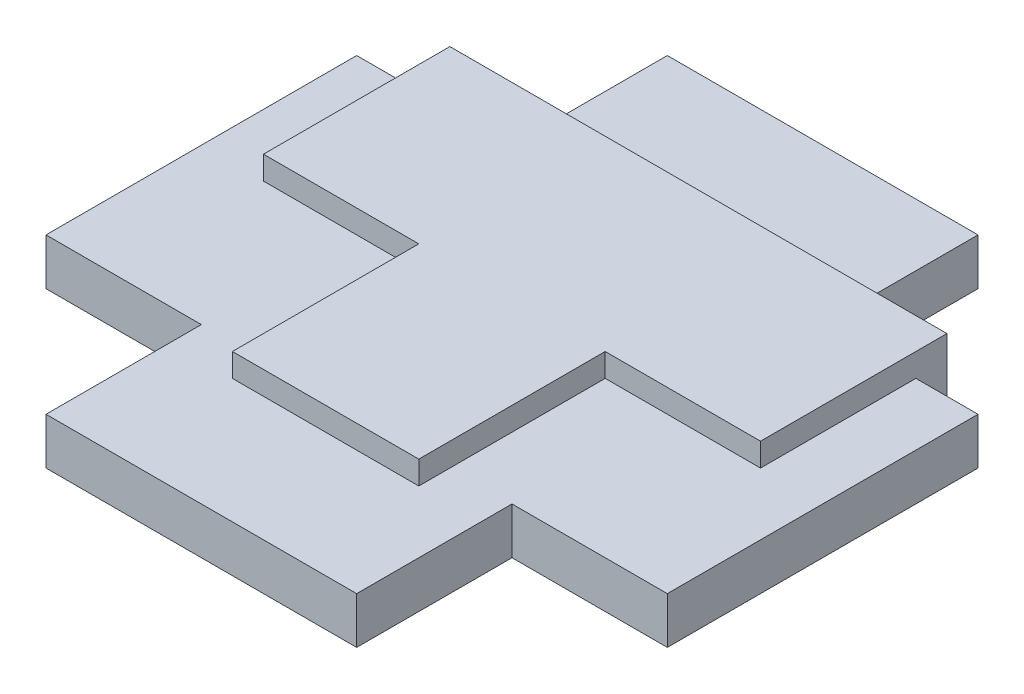
ISO-10303-21;
HEADER;
FILE_DESCRIPTION(('STEP AP214'),'2;1');
FILE_NAME('part.step','',(''),(''),'','','');
FILE_SCHEMA(('AUTOMOTIVE_DESIGN { 1 0 10303 214 1 1 1 1 }'));
ENDSEC;
DATA;
#1=APPLICATION_CONTEXT('core data for automotive mechanical design processes');
#2=APPLICATION_PROTOCOL_DEFINITION('international standard','automotive_design',2000,#1);
#3=PRODUCT_CONTEXT('',#1,'mechanical');
#4=PRODUCT('Part','Part','',(#3));
#5=PRODUCT_RELATED_PRODUCT_CATEGORY('part','',(#4));
#6=PRODUCT_DEFINITION_FORMATION('','',#4);
#7=PRODUCT_DEFINITION_CONTEXT('part definition',#1,'design');
#8=PRODUCT_DEFINITION('design','',#6,#7);
#9=PRODUCT_DEFINITION_SHAPE('','',#8);
#10=(LENGTH_UNIT() NAMED_UNIT(*) SI_UNIT(.MILLI.,.METRE.));
#11=(NAMED_UNIT(*) PLANE_ANGLE_UNIT() SI_UNIT($,.RADIAN.));
#12=(NAMED_UNIT(*) SI_UNIT($,.STERADIAN.) SOLID_ANGLE_UNIT());
#13=UNCERTAINTY_MEASURE_WITH_UNIT(LENGTH_MEASURE(1.E-05),#10,'distance_accuracy_value','');
#14=(GEOMETRIC_REPRESENTATION_CONTEXT(3) GLOBAL_UNCERTAINTY_ASSIGNED_CONTEXT((#13)) GLOBAL_UNIT_ASSIGNED_CONTEXT((#10,
#11,#12)) REPRESENTATION_CONTEXT('',''));
#15=CARTESIAN_POINT('',(0.,0.,0.));
#16=DIRECTION('',(0.,0.,1.));
#17=DIRECTION('',(1.,0.,0.));
#18=AXIS2_PLACEMENT_3D('',#15,#16,#17);
#19=CARTESIAN_POINT('',(3.,3.,0.));
#20=DIRECTION('',(1.,0.,0.));
#21=DIRECTION('',(0.,0.,-1.));
#22=AXIS2_PLACEMENT_3D('',#19,#20,#21);
#23=PLANE('',#22);
#24=DIRECTION('',(0.,-1.,0.));
#25=VECTOR('',#24,1.);
#26=CARTESIAN_POINT('',(3.,3.,0.));
#27=LINE('',#26,#25);
#28=CARTESIAN_POINT('',(3.,0.75,0.));
#29=VERTEX_POINT('',#28);
#30=CARTESIAN_POINT('',(3.,0.,0.));
#31=VERTEX_POINT('',#30);
#32=EDGE_CURVE('E490',#29,#31,#27,.T.);
#33=ORIENTED_EDGE('',*,*,#32,.F.);
#34=DIRECTION('',(0.,0.,1.));
#35=VECTOR('',#34,1.);
#36=CARTESIAN_POINT('',(3.,0.75,0.));
#37=LINE('',#36,#35);
#38=CARTESIAN_POINT('',(3.,0.75,6.));
#39=VERTEX_POINT('',#38);
#40=EDGE_CURVE('E394',#29,#39,#37,.T.);
#41=ORIENTED_EDGE('',*,*,#40,.T.);
#42=DIRECTION('',(0.,-1.,0.));
#43=VECTOR('',#42,1.);
#44=CARTESIAN_POINT('',(3.,3.,6.));
#45=LINE('',#44,#43);
#46=CARTESIAN_POINT('',(3.,0.,6.));
#47=VERTEX_POINT('',#46);
#48=EDGE_CURVE('E434',#39,#47,#45,.T.);
#49=ORIENTED_EDGE('',*,*,#48,.T.);
#50=DIRECTION('',(0.,0.,1.));
#51=VECTOR('',#50,1.);
#52=CARTESIAN_POINT('',(3.,0.,0.));
#53=LINE('',#52,#51);
#54=EDGE_CURVE('E406',#31,#47,#53,.T.);
#55=ORIENTED_EDGE('',*,*,#54,.F.);
#56=EDGE_LOOP('',(#33,#41,#49,#55));
#57=FACE_BOUND('',#56,.T.);
#58=ADVANCED_FACE('F41',(#57),#23,.T.);
#59=CARTESIAN_POINT('',(0.,3.,0.));
#60=DIRECTION('',(0.,0.,-1.));
#61=DIRECTION('',(-1.,0.,0.));
#62=AXIS2_PLACEMENT_3D('',#59,#60,#61);
#63=PLANE('',#62);
#64=DIRECTION('',(1.,0.,0.));
#65=VECTOR('',#64,1.);
#66=CARTESIAN_POINT('',(0.,0.75,0.));
#67=LINE('',#66,#65);
#68=CARTESIAN_POINT('',(8.,0.75,0.));
#69=VERTEX_POINT('',#68);
#70=EDGE_CURVE('E57',#29,#69,#67,.T.);
#71=ORIENTED_EDGE('',*,*,#70,.F.);
#72=ORIENTED_EDGE('',*,*,#32,.T.);
#73=DIRECTION('',(1.,0.,0.));
#74=VECTOR('',#73,1.);
#75=CARTESIAN_POINT('',(0.,0.,0.));
#76=LINE('',#75,#74);
#77=CARTESIAN_POINT('',(8.,0.,0.));
#78=VERTEX_POINT('',#77);
#79=EDGE_CURVE('E438',#31,#78,#76,.T.);
#80=ORIENTED_EDGE('',*,*,#79,.T.);
#81=DIRECTION('',(0.,-1.,0.));
#82=VECTOR('',#81,1.);
#83=CARTESIAN_POINT('',(8.,3.,0.));
#84=LINE('',#83,#82);
#85=EDGE_CURVE('E485',#69,#78,#84,.T.);
#86=ORIENTED_EDGE('',*,*,#85,.F.);
#87=EDGE_LOOP('',(#71,#72,#80,#86));
#88=FACE_BOUND('',#87,.T.);
#89=ADVANCED_FACE('F539',(#88),#63,.F.);
#90=CARTESIAN_POINT('',(8.,3.,0.));
#91=DIRECTION('',(-1.,0.,0.));
#92=DIRECTION('',(0.,0.,1.));
#93=AXIS2_PLACEMENT_3D('',#90,#91,#92);
#94=PLANE('',#93);
#95=DIRECTION('',(0.,0.,-1.));
#96=VECTOR('',#95,1.);
#97=CARTESIAN_POINT('',(8.,0.75,0.));
#98=LINE('',#97,#96);
#99=CARTESIAN_POINT('',(8.,0.75,-5.));
#100=VERTEX_POINT('',#99);
#101=EDGE_CURVE('E399',#69,#100,#98,.T.);
#102=ORIENTED_EDGE('',*,*,#101,.F.);
#103=ORIENTED_EDGE('',*,*,#85,.T.);
#104=DIRECTION('',(0.,0.,-1.));
#105=VECTOR('',#104,1.);
#106=CARTESIAN_POINT('',(8.,0.,0.));
#107=LINE('',#106,#105);
#108=CARTESIAN_POINT('',(8.,0.,-6.));
#109=VERTEX_POINT('',#108);
#110=EDGE_CURVE('E442',#78,#109,#107,.T.);
#111=ORIENTED_EDGE('',*,*,#110,.T.);
#112=DIRECTION('',(0.,-1.,0.));
#113=VECTOR('',#112,1.);
#114=CARTESIAN_POINT('',(8.,3.,-6.));
#115=LINE('',#114,#113);
#116=CARTESIAN_POINT('',(8.,3.,-6.));
#117=VERTEX_POINT('',#116);
#118=EDGE_CURVE('E482',#117,#109,#115,.T.);
#119=ORIENTED_EDGE('',*,*,#118,.F.);
#120=DIRECTION('',(0.,0.,-1.));
#121=VECTOR('',#120,1.);
#122=CARTESIAN_POINT('',(8.,3.,0.));
#123=LINE('',#122,#121);
#124=CARTESIAN_POINT('',(8.,3.,0.));
#125=VERTEX_POINT('',#124);
#126=EDGE_CURVE('E415',#125,#117,#123,.T.);
#127=ORIENTED_EDGE('',*,*,#126,.F.);
#128=CARTESIAN_POINT('',(8.,2.25,0.));
#129=VERTEX_POINT('',#128);
#130=EDGE_CURVE('E486',#125,#129,#84,.T.);
#131=ORIENTED_EDGE('',*,*,#130,.T.);
#132=DIRECTION('',(0.,0.,-1.));
#133=VECTOR('',#132,1.);
#134=CARTESIAN_POINT('',(8.,2.25,0.));
#135=LINE('',#134,#133);
#136=CARTESIAN_POINT('',(8.,2.25,-5.));
#137=VERTEX_POINT('',#136);
#138=EDGE_CURVE('E376',#129,#137,#135,.T.);
#139=ORIENTED_EDGE('',*,*,#138,.T.);
#140=DIRECTION('',(0.,-1.,0.));
#141=VECTOR('',#140,1.);
#142=CARTESIAN_POINT('',(8.,3.,-5.));
#143=LINE('',#142,#141);
#144=EDGE_CURVE('E11',#137,#100,#143,.T.);
#145=ORIENTED_EDGE('',*,*,#144,.T.);
#146=EDGE_LOOP('',(#102,#103,#111,#119,#127,#131,#139,#145));
#147=FACE_BOUND('',#146,.T.);
#148=ADVANCED_FACE('F544',(#147),#94,.F.);
#149=CARTESIAN_POINT('',(0.,3.,-6.));
#150=DIRECTION('',(0.,0.,-1.));
#151=DIRECTION('',(-1.,0.,0.));
#152=AXIS2_PLACEMENT_3D('',#149,#150,#151);
#153=PLANE('',#152);
#154=DIRECTION('',(1.,0.,0.));
#155=VECTOR('',#154,1.);
#156=CARTESIAN_POINT('',(0.,0.,-6.));
#157=LINE('',#156,#155);
#158=CARTESIAN_POINT('',(-8.,0.,-6.));
#159=VERTEX_POINT('',#158);
#160=EDGE_CURVE('E447',#159,#109,#157,.T.);
#161=ORIENTED_EDGE('',*,*,#160,.F.);
#162=DIRECTION('',(0.,-1.,0.));
#163=VECTOR('',#162,1.);
#164=CARTESIAN_POINT('',(-8.,3.,-6.));
#165=LINE('',#164,#163);
#166=CARTESIAN_POINT('',(-8.,3.,-6.));
#167=VERTEX_POINT('',#166);
#168=EDGE_CURVE('E479',#167,#159,#165,.T.);
#169=ORIENTED_EDGE('',*,*,#168,.F.);
#170=DIRECTION('',(1.,0.,0.));
#171=VECTOR('',#170,1.);
#172=CARTESIAN_POINT('',(0.,3.,-6.));
#173=LINE('',#172,#171);
#174=EDGE_CURVE('E419',#167,#117,#173,.T.);
#175=ORIENTED_EDGE('',*,*,#174,.T.);
#176=ORIENTED_EDGE('',*,*,#118,.T.);
#177=EDGE_LOOP('',(#161,#169,#175,#176));
#178=FACE_BOUND('',#177,.T.);
#179=DIRECTION('',(0.,-1.,0.));
#180=VECTOR('',#179,1.);
#181=CARTESIAN_POINT('',(-5.,3.,-6.));
#182=LINE('',#181,#180);
#183=CARTESIAN_POINT('',(-5.,2.25,-6.));
#184=VERTEX_POINT('',#183);
#185=CARTESIAN_POINT('',(-5.,0.75,-6.));
#186=VERTEX_POINT('',#185);
#187=EDGE_CURVE('E50',#184,#186,#182,.T.);
#188=ORIENTED_EDGE('',*,*,#187,.T.);
#189=DIRECTION('',(1.,0.,0.));
#190=VECTOR('',#189,1.);
#191=CARTESIAN_POINT('',(0.,0.75,-6.));
#192=LINE('',#191,#190);
#193=CARTESIAN_POINT('',(5.,0.75,-6.));
#194=VERTEX_POINT('',#193);
#195=EDGE_CURVE('E403',#186,#194,#192,.T.);
#196=ORIENTED_EDGE('',*,*,#195,.T.);
#197=DIRECTION('',(0.,-1.,0.));
#198=VECTOR('',#197,1.);
#199=CARTESIAN_POINT('',(5.,3.,-6.));
#200=LINE('',#199,#198);
#201=CARTESIAN_POINT('',(5.,2.25,-6.));
#202=VERTEX_POINT('',#201);
#203=EDGE_CURVE('E504',#202,#194,#200,.T.);
#204=ORIENTED_EDGE('',*,*,#203,.F.);
#205=DIRECTION('',(1.,0.,0.));
#206=VECTOR('',#205,1.);
#207=CARTESIAN_POINT('',(0.,2.25,-6.));
#208=LINE('',#207,#206);
#209=EDGE_CURVE('E379',#184,#202,#208,.T.);
#210=ORIENTED_EDGE('',*,*,#209,.F.);
#211=EDGE_LOOP('',(#188,#196,#204,#210));
#212=FACE_BOUND('',#211,.T.);
#213=ADVANCED_FACE('F511',(#178,#212),#153,.T.);
#214=CARTESIAN_POINT('',(-8.,3.,0.));
#215=DIRECTION('',(-1.,0.,0.));
#216=DIRECTION('',(0.,0.,1.));
#217=AXIS2_PLACEMENT_3D('',#214,#215,#216);
#218=PLANE('',#217);
#219=DIRECTION('',(0.,-1.,0.));
#220=VECTOR('',#219,1.);
#221=CARTESIAN_POINT('',(-8.,3.,0.));
#222=LINE('',#221,#220);
#223=CARTESIAN_POINT('',(-8.,0.75,0.));
#224=VERTEX_POINT('',#223);
#225=CARTESIAN_POINT('',(-8.,0.,0.));
#226=VERTEX_POINT('',#225);
#227=EDGE_CURVE('E474',#224,#226,#222,.T.);
#228=ORIENTED_EDGE('',*,*,#227,.F.);
#229=DIRECTION('',(0.,0.,-1.));
#230=VECTOR('',#229,1.);
#231=CARTESIAN_POINT('',(-8.,0.75,0.));
#232=LINE('',#231,#230);
#233=CARTESIAN_POINT('',(-8.,0.75,-5.));
#234=VERTEX_POINT('',#233);
#235=EDGE_CURVE('E391',#224,#234,#232,.T.);
#236=ORIENTED_EDGE('',*,*,#235,.T.);
#237=DIRECTION('',(0.,-1.,0.));
#238=VECTOR('',#237,1.);
#239=CARTESIAN_POINT('',(-8.,3.,-5.));
#240=LINE('',#239,#238);
#241=CARTESIAN_POINT('',(-8.,2.25,-5.));
#242=VERTEX_POINT('',#241);
#243=EDGE_CURVE('E501',#242,#234,#240,.T.);
#244=ORIENTED_EDGE('',*,*,#243,.F.);
#245=DIRECTION('',(0.,0.,-1.));
#246=VECTOR('',#245,1.);
#247=CARTESIAN_POINT('',(-8.,2.25,0.));
#248=LINE('',#247,#246);
#249=CARTESIAN_POINT('',(-8.,2.25,0.));
#250=VERTEX_POINT('',#249);
#251=EDGE_CURVE('E238',#250,#242,#248,.T.);
#252=ORIENTED_EDGE('',*,*,#251,.F.);
#253=CARTESIAN_POINT('',(-8.,3.,0.));
#254=VERTEX_POINT('',#253);
#255=EDGE_CURVE('E475',#254,#250,#222,.T.);
#256=ORIENTED_EDGE('',*,*,#255,.F.);
#257=DIRECTION('',(0.,0.,-1.));
#258=VECTOR('',#257,1.);
#259=CARTESIAN_POINT('',(-8.,3.,0.));
#260=LINE('',#259,#258);
#261=EDGE_CURVE('E423',#254,#167,#260,.T.);
#262=ORIENTED_EDGE('',*,*,#261,.T.);
#263=ORIENTED_EDGE('',*,*,#168,.T.);
#264=DIRECTION('',(0.,0.,-1.));
#265=VECTOR('',#264,1.);
#266=CARTESIAN_POINT('',(-8.,0.,0.));
#267=LINE('',#266,#265);
#268=EDGE_CURVE('E451',#226,#159,#267,.T.);
#269=ORIENTED_EDGE('',*,*,#268,.F.);
#270=EDGE_LOOP('',(#228,#236,#244,#252,#256,#262,#263,#269));
#271=FACE_BOUND('',#270,.T.);
#272=ADVANCED_FACE('F598',(#271),#218,.T.);
#273=DIRECTION('',(1.,0.,0.));
#274=VECTOR('',#273,1.);
#275=CARTESIAN_POINT('',(0.,0.75,0.));
#276=LINE('',#275,#274);
#277=CARTESIAN_POINT('',(-3.,0.75,0.));
#278=VERTEX_POINT('',#277);
#279=EDGE_CURVE('E387',#224,#278,#276,.T.);
#280=ORIENTED_EDGE('',*,*,#279,.F.);
#281=ORIENTED_EDGE('',*,*,#227,.T.);
#282=CARTESIAN_POINT('',(-3.,0.,0.));
#283=VERTEX_POINT('',#282);
#284=EDGE_CURVE('E443',#226,#283,#76,.T.);
#285=ORIENTED_EDGE('',*,*,#284,.T.);
#286=DIRECTION('',(0.,-1.,0.));
#287=VECTOR('',#286,1.);
#288=CARTESIAN_POINT('',(-3.,3.,0.));
#289=LINE('',#288,#287);
#290=EDGE_CURVE('E469',#278,#283,#289,.T.);
#291=ORIENTED_EDGE('',*,*,#290,.F.);
#292=EDGE_LOOP('',(#280,#281,#285,#291));
#293=FACE_BOUND('',#292,.T.);
#294=ADVANCED_FACE('F546',(#293),#63,.F.);
#295=CARTESIAN_POINT('',(-3.,3.,0.));
#296=DIRECTION('',(1.,0.,0.));
#297=DIRECTION('',(0.,0.,-1.));
#298=AXIS2_PLACEMENT_3D('',#295,#296,#297);
#299=PLANE('',#298);
#300=DIRECTION('',(0.,0.,1.));
#301=VECTOR('',#300,1.);
#302=CARTESIAN_POINT('',(-3.,0.75,0.));
#303=LINE('',#302,#301);
#304=CARTESIAN_POINT('',(-3.,0.75,6.));
#305=VERTEX_POINT('',#304);
#306=EDGE_CURVE('E383',#278,#305,#303,.T.);
#307=ORIENTED_EDGE('',*,*,#306,.F.);
#308=ORIENTED_EDGE('',*,*,#290,.T.);
#309=DIRECTION('',(0.,0.,1.));
#310=VECTOR('',#309,1.);
#311=CARTESIAN_POINT('',(-3.,0.,0.));
#312=LINE('',#311,#310);
#313=CARTESIAN_POINT('',(-3.,0.,6.));
#314=VERTEX_POINT('',#313);
#315=EDGE_CURVE('E455',#283,#314,#312,.T.);
#316=ORIENTED_EDGE('',*,*,#315,.T.);
#317=DIRECTION('',(0.,-1.,0.));
#318=VECTOR('',#317,1.);
#319=CARTESIAN_POINT('',(-3.,3.,6.));
#320=LINE('',#319,#318);
#321=EDGE_CURVE('E465',#305,#314,#320,.T.);
#322=ORIENTED_EDGE('',*,*,#321,.F.);
#323=EDGE_LOOP('',(#307,#308,#316,#322));
#324=FACE_BOUND('',#323,.T.);
#325=ADVANCED_FACE('F556',(#324),#299,.F.);
#326=CARTESIAN_POINT('',(0.,3.,6.));
#327=DIRECTION('',(0.,0.,1.));
#328=DIRECTION('',(1.,0.,0.));
#329=AXIS2_PLACEMENT_3D('',#326,#327,#328);
#330=PLANE('',#329);
#331=ORIENTED_EDGE('',*,*,#48,.F.);
#332=DIRECTION('',(-1.,0.,0.));
#333=VECTOR('',#332,1.);
#334=CARTESIAN_POINT('',(0.,0.75,6.));
#335=LINE('',#334,#333);
#336=EDGE_CURVE('E498',#39,#305,#335,.T.);
#337=ORIENTED_EDGE('',*,*,#336,.T.);
#338=ORIENTED_EDGE('',*,*,#321,.T.);
#339=DIRECTION('',(-1.,0.,0.));
#340=VECTOR('',#339,1.);
#341=CARTESIAN_POINT('',(0.,0.,6.));
#342=LINE('',#341,#340);
#343=EDGE_CURVE('E412',#47,#314,#342,.T.);
#344=ORIENTED_EDGE('',*,*,#343,.F.);
#345=EDGE_LOOP('',(#331,#337,#338,#344));
#346=FACE_BOUND('',#345,.T.);
#347=ADVANCED_FACE('F550',(#346),#330,.T.);
#348=DIRECTION('',(0.,0.,1.));
#349=VECTOR('',#348,1.);
#350=CARTESIAN_POINT('',(3.,2.25,0.));
#351=LINE('',#350,#349);
#352=CARTESIAN_POINT('',(3.,2.25,0.));
#353=VERTEX_POINT('',#352);
#354=CARTESIAN_POINT('',(3.,2.25,6.));
#355=VERTEX_POINT('',#354);
#356=EDGE_CURVE('E65',#353,#355,#351,.T.);
#357=ORIENTED_EDGE('',*,*,#356,.F.);
#358=CARTESIAN_POINT('',(3.,3.,0.));
#359=VERTEX_POINT('',#358);
#360=EDGE_CURVE('E491',#359,#353,#27,.T.);
#361=ORIENTED_EDGE('',*,*,#360,.F.);
#362=DIRECTION('',(0.,0.,1.));
#363=VECTOR('',#362,1.);
#364=CARTESIAN_POINT('',(3.,3.,0.));
#365=LINE('',#364,#363);
#366=CARTESIAN_POINT('',(3.,3.,6.));
#367=VERTEX_POINT('',#366);
#368=EDGE_CURVE('E407',#359,#367,#365,.T.);
#369=ORIENTED_EDGE('',*,*,#368,.T.);
#370=EDGE_CURVE('E462',#367,#355,#45,.T.);
#371=ORIENTED_EDGE('',*,*,#370,.T.);
#372=EDGE_LOOP('',(#357,#361,#369,#371));
#373=FACE_BOUND('',#372,.T.);
#374=ADVANCED_FACE('F43',(#373),#23,.T.);
#375=ORIENTED_EDGE('',*,*,#360,.T.);
#376=DIRECTION('',(1.,0.,0.));
#377=VECTOR('',#376,1.);
#378=CARTESIAN_POINT('',(0.,2.25,0.));
#379=LINE('',#378,#377);
#380=EDGE_CURVE('E373',#353,#129,#379,.T.);
#381=ORIENTED_EDGE('',*,*,#380,.T.);
#382=ORIENTED_EDGE('',*,*,#130,.F.);
#383=DIRECTION('',(1.,0.,0.));
#384=VECTOR('',#383,1.);
#385=CARTESIAN_POINT('',(0.,3.,0.));
#386=LINE('',#385,#384);
#387=EDGE_CURVE('E411',#359,#125,#386,.T.);
#388=ORIENTED_EDGE('',*,*,#387,.F.);
#389=EDGE_LOOP('',(#375,#381,#382,#388));
#390=FACE_BOUND('',#389,.T.);
#391=ADVANCED_FACE('F549',(#390),#63,.F.);
#392=ORIENTED_EDGE('',*,*,#255,.T.);
#393=DIRECTION('',(1.,0.,0.));
#394=VECTOR('',#393,1.);
#395=CARTESIAN_POINT('',(0.,2.25,0.));
#396=LINE('',#395,#394);
#397=CARTESIAN_POINT('',(-3.,2.25,0.));
#398=VERTEX_POINT('',#397);
#399=EDGE_CURVE('E366',#250,#398,#396,.T.);
#400=ORIENTED_EDGE('',*,*,#399,.T.);
#401=CARTESIAN_POINT('',(-3.,3.,0.));
#402=VERTEX_POINT('',#401);
#403=EDGE_CURVE('E470',#402,#398,#289,.T.);
#404=ORIENTED_EDGE('',*,*,#403,.F.);
#405=EDGE_CURVE('E416',#254,#402,#386,.T.);
#406=ORIENTED_EDGE('',*,*,#405,.F.);
#407=EDGE_LOOP('',(#392,#400,#404,#406));
#408=FACE_BOUND('',#407,.T.);
#409=ADVANCED_FACE('F547',(#408),#63,.F.);
#410=ORIENTED_EDGE('',*,*,#403,.T.);
#411=DIRECTION('',(0.,0.,1.));
#412=VECTOR('',#411,1.);
#413=CARTESIAN_POINT('',(-3.,2.25,0.));
#414=LINE('',#413,#412);
#415=CARTESIAN_POINT('',(-3.,2.25,6.));
#416=VERTEX_POINT('',#415);
#417=EDGE_CURVE('E338',#398,#416,#414,.T.);
#418=ORIENTED_EDGE('',*,*,#417,.T.);
#419=CARTESIAN_POINT('',(-3.,3.,6.));
#420=VERTEX_POINT('',#419);
#421=EDGE_CURVE('E466',#420,#416,#320,.T.);
#422=ORIENTED_EDGE('',*,*,#421,.F.);
#423=DIRECTION('',(0.,0.,1.));
#424=VECTOR('',#423,1.);
#425=CARTESIAN_POINT('',(-3.,3.,0.));
#426=LINE('',#425,#424);
#427=EDGE_CURVE('E427',#402,#420,#426,.T.);
#428=ORIENTED_EDGE('',*,*,#427,.F.);
#429=EDGE_LOOP('',(#410,#418,#422,#428));
#430=FACE_BOUND('',#429,.T.);
#431=ADVANCED_FACE('F565',(#430),#299,.F.);
#432=DIRECTION('',(-1.,0.,0.));
#433=VECTOR('',#432,1.);
#434=CARTESIAN_POINT('',(0.,2.25,6.));
#435=LINE('',#434,#433);
#436=EDGE_CURVE('E494',#355,#416,#435,.T.);
#437=ORIENTED_EDGE('',*,*,#436,.F.);
#438=ORIENTED_EDGE('',*,*,#370,.F.);
#439=DIRECTION('',(-1.,0.,0.));
#440=VECTOR('',#439,1.);
#441=CARTESIAN_POINT('',(0.,3.,6.));
#442=LINE('',#441,#440);
#443=EDGE_CURVE('E430',#367,#420,#442,.T.);
#444=ORIENTED_EDGE('',*,*,#443,.T.);
#445=ORIENTED_EDGE('',*,*,#421,.T.);
#446=EDGE_LOOP('',(#437,#438,#444,#445));
#447=FACE_BOUND('',#446,.T.);
#448=ADVANCED_FACE('F559',(#447),#330,.T.);
#449=CARTESIAN_POINT('',(0.,3.,0.));
#450=DIRECTION('',(0.,1.,0.));
#451=DIRECTION('',(0.,0.,1.));
#452=AXIS2_PLACEMENT_3D('',#449,#450,#451);
#453=PLANE('',#452);
#454=ORIENTED_EDGE('',*,*,#368,.F.);
#455=ORIENTED_EDGE('',*,*,#387,.T.);
#456=ORIENTED_EDGE('',*,*,#126,.T.);
#457=ORIENTED_EDGE('',*,*,#174,.F.);
#458=ORIENTED_EDGE('',*,*,#261,.F.);
#459=ORIENTED_EDGE('',*,*,#405,.T.);
#460=ORIENTED_EDGE('',*,*,#427,.T.);
#461=ORIENTED_EDGE('',*,*,#443,.F.);
#462=EDGE_LOOP('',(#454,#455,#456,#457,#458,#459,#460,#461));
#463=FACE_BOUND('',#462,.T.);
#464=ADVANCED_FACE('F569',(#463),#453,.T.);
#465=CARTESIAN_POINT('',(0.,0.,0.));
#466=DIRECTION('',(0.,1.,0.));
#467=DIRECTION('',(0.,0.,1.));
#468=AXIS2_PLACEMENT_3D('',#465,#466,#467);
#469=PLANE('',#468);
#470=ORIENTED_EDGE('',*,*,#54,.T.);
#471=ORIENTED_EDGE('',*,*,#343,.T.);
#472=ORIENTED_EDGE('',*,*,#315,.F.);
#473=ORIENTED_EDGE('',*,*,#284,.F.);
#474=ORIENTED_EDGE('',*,*,#268,.T.);
#475=ORIENTED_EDGE('',*,*,#160,.T.);
#476=ORIENTED_EDGE('',*,*,#110,.F.);
#477=ORIENTED_EDGE('',*,*,#79,.F.);
#478=EDGE_LOOP('',(#470,#471,#472,#473,#474,#475,#476,#477));
#479=FACE_BOUND('',#478,.T.);
#480=ADVANCED_FACE('F575',(#479),#469,.F.);
#481=CARTESIAN_POINT('',(10.,0.75,0.));
#482=DIRECTION('',(-1.,0.,0.));
#483=DIRECTION('',(0.,0.,1.));
#484=AXIS2_PLACEMENT_3D('',#481,#482,#483);
#485=PLANE('',#484);
#486=DIRECTION('',(0.,1.,0.));
#487=VECTOR('',#486,1.);
#488=CARTESIAN_POINT('',(10.,0.75,-5.));
#489=LINE('',#488,#487);
#490=CARTESIAN_POINT('',(10.,0.75,-5.));
#491=VERTEX_POINT('',#490);
#492=CARTESIAN_POINT('',(10.,2.25,-5.));
#493=VERTEX_POINT('',#492);
#494=EDGE_CURVE('E343',#491,#493,#489,.T.);
#495=ORIENTED_EDGE('',*,*,#494,.T.);
#496=DIRECTION('',(0.,0.,1.));
#497=VECTOR('',#496,1.);
#498=CARTESIAN_POINT('',(10.,2.25,0.));
#499=LINE('',#498,#497);
#500=CARTESIAN_POINT('',(10.,2.25,5.));
#501=VERTEX_POINT('',#500);
#502=EDGE_CURVE('E279',#493,#501,#499,.T.);
#503=ORIENTED_EDGE('',*,*,#502,.T.);
#504=DIRECTION('',(0.,1.,0.));
#505=VECTOR('',#504,1.);
#506=CARTESIAN_POINT('',(10.,0.75,5.));
#507=LINE('',#506,#505);
#508=CARTESIAN_POINT('',(10.,0.75,5.));
#509=VERTEX_POINT('',#508);
#510=EDGE_CURVE('E346',#509,#501,#507,.T.);
#511=ORIENTED_EDGE('',*,*,#510,.F.);
#512=DIRECTION('',(0.,0.,1.));
#513=VECTOR('',#512,1.);
#514=CARTESIAN_POINT('',(10.,0.75,0.));
#515=LINE('',#514,#513);
#516=EDGE_CURVE('E318',#491,#509,#515,.T.);
#517=ORIENTED_EDGE('',*,*,#516,.F.);
#518=EDGE_LOOP('',(#495,#503,#511,#517));
#519=FACE_BOUND('',#518,.T.);
#520=ADVANCED_FACE('F626',(#519),#485,.F.);
#521=CARTESIAN_POINT('',(0.,0.75,5.));
#522=DIRECTION('',(0.,0.,-1.));
#523=DIRECTION('',(-1.,0.,0.));
#524=AXIS2_PLACEMENT_3D('',#521,#522,#523);
#525=PLANE('',#524);
#526=ORIENTED_EDGE('',*,*,#510,.T.);
#527=DIRECTION('',(-1.,0.,0.));
#528=VECTOR('',#527,1.);
#529=CARTESIAN_POINT('',(0.,2.25,5.));
#530=LINE('',#529,#528);
#531=CARTESIAN_POINT('',(5.,2.25,5.));
#532=VERTEX_POINT('',#531);
#533=EDGE_CURVE('E275',#501,#532,#530,.T.);
#534=ORIENTED_EDGE('',*,*,#533,.T.);
#535=DIRECTION('',(0.,1.,0.));
#536=VECTOR('',#535,1.);
#537=CARTESIAN_POINT('',(5.,0.75,5.));
#538=LINE('',#537,#536);
#539=CARTESIAN_POINT('',(5.,0.75,5.));
#540=VERTEX_POINT('',#539);
#541=EDGE_CURVE('E349',#540,#532,#538,.T.);
#542=ORIENTED_EDGE('',*,*,#541,.F.);
#543=DIRECTION('',(-1.,0.,0.));
#544=VECTOR('',#543,1.);
#545=CARTESIAN_POINT('',(0.,0.75,5.));
#546=LINE('',#545,#544);
#547=EDGE_CURVE('E315',#509,#540,#546,.T.);
#548=ORIENTED_EDGE('',*,*,#547,.F.);
#549=EDGE_LOOP('',(#526,#534,#542,#548));
#550=FACE_BOUND('',#549,.T.);
#551=ADVANCED_FACE('F621',(#550),#525,.F.);
#552=CARTESIAN_POINT('',(5.,0.75,0.));
#553=DIRECTION('',(1.,0.,0.));
#554=DIRECTION('',(0.,0.,-1.));
#555=AXIS2_PLACEMENT_3D('',#552,#553,#554);
#556=PLANE('',#555);
#557=ORIENTED_EDGE('',*,*,#541,.T.);
#558=DIRECTION('',(0.,0.,-1.));
#559=VECTOR('',#558,1.);
#560=CARTESIAN_POINT('',(5.,2.25,0.));
#561=LINE('',#560,#559);
#562=CARTESIAN_POINT('',(5.,2.25,10.));
#563=VERTEX_POINT('',#562);
#564=EDGE_CURVE('E271',#563,#532,#561,.T.);
#565=ORIENTED_EDGE('',*,*,#564,.F.);
#566=DIRECTION('',(0.,1.,0.));
#567=VECTOR('',#566,1.);
#568=CARTESIAN_POINT('',(5.,0.75,10.));
#569=LINE('',#568,#567);
#570=CARTESIAN_POINT('',(5.,0.75,10.));
#571=VERTEX_POINT('',#570);
#572=EDGE_CURVE('E352',#571,#563,#569,.T.);
#573=ORIENTED_EDGE('',*,*,#572,.F.);
#574=DIRECTION('',(0.,0.,-1.));
#575=VECTOR('',#574,1.);
#576=CARTESIAN_POINT('',(5.,0.75,0.));
#577=LINE('',#576,#575);
#578=EDGE_CURVE('E311',#571,#540,#577,.T.);
#579=ORIENTED_EDGE('',*,*,#578,.T.);
#580=EDGE_LOOP('',(#557,#565,#573,#579));
#581=FACE_BOUND('',#580,.T.);
#582=ADVANCED_FACE('F695',(#581),#556,.T.);
#583=CARTESIAN_POINT('',(0.,0.75,10.));
#584=DIRECTION('',(0.,0.,-1.));
#585=DIRECTION('',(-1.,0.,0.));
#586=AXIS2_PLACEMENT_3D('',#583,#584,#585);
#587=PLANE('',#586);
#588=ORIENTED_EDGE('',*,*,#572,.T.);
#589=DIRECTION('',(-1.,0.,0.));
#590=VECTOR('',#589,1.);
#591=CARTESIAN_POINT('',(0.,2.25,10.));
#592=LINE('',#591,#590);
#593=CARTESIAN_POINT('',(-5.,2.25,10.));
#594=VERTEX_POINT('',#593);
#595=EDGE_CURVE('E267',#563,#594,#592,.T.);
#596=ORIENTED_EDGE('',*,*,#595,.T.);
#597=DIRECTION('',(0.,1.,0.));
#598=VECTOR('',#597,1.);
#599=CARTESIAN_POINT('',(-5.,0.75,10.));
#600=LINE('',#599,#598);
#601=CARTESIAN_POINT('',(-5.,0.75,10.));
#602=VERTEX_POINT('',#601);
#603=EDGE_CURVE('E355',#602,#594,#600,.T.);
#604=ORIENTED_EDGE('',*,*,#603,.F.);
#605=DIRECTION('',(-1.,0.,0.));
#606=VECTOR('',#605,1.);
#607=CARTESIAN_POINT('',(0.,0.75,10.));
#608=LINE('',#607,#606);
#609=EDGE_CURVE('E308',#571,#602,#608,.T.);
#610=ORIENTED_EDGE('',*,*,#609,.F.);
#611=EDGE_LOOP('',(#588,#596,#604,#610));
#612=FACE_BOUND('',#611,.T.);
#613=ADVANCED_FACE('F613',(#612),#587,.F.);
#614=CARTESIAN_POINT('',(-5.,0.75,0.));
#615=DIRECTION('',(1.,0.,0.));
#616=DIRECTION('',(0.,0.,-1.));
#617=AXIS2_PLACEMENT_3D('',#614,#615,#616);
#618=PLANE('',#617);
#619=ORIENTED_EDGE('',*,*,#603,.T.);
#620=DIRECTION('',(0.,0.,-1.));
#621=VECTOR('',#620,1.);
#622=CARTESIAN_POINT('',(-5.,2.25,0.));
#623=LINE('',#622,#621);
#624=CARTESIAN_POINT('',(-5.,2.25,5.));
#625=VERTEX_POINT('',#624);
#626=EDGE_CURVE('E261',#594,#625,#623,.T.);
#627=ORIENTED_EDGE('',*,*,#626,.T.);
#628=DIRECTION('',(0.,1.,0.));
#629=VECTOR('',#628,1.);
#630=CARTESIAN_POINT('',(-5.,0.75,5.));
#631=LINE('',#630,#629);
#632=CARTESIAN_POINT('',(-5.,0.75,5.));
#633=VERTEX_POINT('',#632);
#634=EDGE_CURVE('E358',#633,#625,#631,.T.);
#635=ORIENTED_EDGE('',*,*,#634,.F.);
#636=DIRECTION('',(0.,0.,-1.));
#637=VECTOR('',#636,1.);
#638=CARTESIAN_POINT('',(-5.,0.75,0.));
#639=LINE('',#638,#637);
#640=EDGE_CURVE('E305',#602,#633,#639,.T.);
#641=ORIENTED_EDGE('',*,*,#640,.F.);
#642=EDGE_LOOP('',(#619,#627,#635,#641));
#643=FACE_BOUND('',#642,.T.);
#644=ADVANCED_FACE('F609',(#643),#618,.F.);
#645=CARTESIAN_POINT('',(0.,0.75,5.));
#646=DIRECTION('',(0.,0.,-1.));
#647=DIRECTION('',(-1.,0.,0.));
#648=AXIS2_PLACEMENT_3D('',#645,#646,#647);
#649=PLANE('',#648);
#650=ORIENTED_EDGE('',*,*,#634,.T.);
#651=DIRECTION('',(-1.,0.,0.));
#652=VECTOR('',#651,1.);
#653=CARTESIAN_POINT('',(0.,2.25,5.));
#654=LINE('',#653,#652);
#655=CARTESIAN_POINT('',(-10.,2.25,5.));
#656=VERTEX_POINT('',#655);
#657=EDGE_CURVE('E258',#625,#656,#654,.T.);
#658=ORIENTED_EDGE('',*,*,#657,.T.);
#659=DIRECTION('',(0.,1.,0.));
#660=VECTOR('',#659,1.);
#661=CARTESIAN_POINT('',(-10.,0.75,5.));
#662=LINE('',#661,#660);
#663=CARTESIAN_POINT('',(-10.,0.75,5.));
#664=VERTEX_POINT('',#663);
#665=EDGE_CURVE('E252',#664,#656,#662,.T.);
#666=ORIENTED_EDGE('',*,*,#665,.F.);
#667=DIRECTION('',(-1.,0.,0.));
#668=VECTOR('',#667,1.);
#669=CARTESIAN_POINT('',(0.,0.75,5.));
#670=LINE('',#669,#668);
#671=EDGE_CURVE('E302',#633,#664,#670,.T.);
#672=ORIENTED_EDGE('',*,*,#671,.F.);
#673=EDGE_LOOP('',(#650,#658,#666,#672));
#674=FACE_BOUND('',#673,.T.);
#675=ADVANCED_FACE('F605',(#674),#649,.F.);
#676=CARTESIAN_POINT('',(-10.,0.75,0.));
#677=DIRECTION('',(-1.,0.,0.));
#678=DIRECTION('',(0.,0.,1.));
#679=AXIS2_PLACEMENT_3D('',#676,#677,#678);
#680=PLANE('',#679);
#681=ORIENTED_EDGE('',*,*,#665,.T.);
#682=DIRECTION('',(0.,0.,1.));
#683=VECTOR('',#682,1.);
#684=CARTESIAN_POINT('',(-10.,2.25,0.));
#685=LINE('',#684,#683);
#686=CARTESIAN_POINT('',(-10.,2.25,-5.));
#687=VERTEX_POINT('',#686);
#688=EDGE_CURVE('E235',#687,#656,#685,.T.);
#689=ORIENTED_EDGE('',*,*,#688,.F.);
#690=DIRECTION('',(0.,1.,0.));
#691=VECTOR('',#690,1.);
#692=CARTESIAN_POINT('',(-10.,0.75,-5.));
#693=LINE('',#692,#691);
#694=CARTESIAN_POINT('',(-10.,0.75,-5.));
#695=VERTEX_POINT('',#694);
#696=EDGE_CURVE('E244',#695,#687,#693,.T.);
#697=ORIENTED_EDGE('',*,*,#696,.F.);
#698=DIRECTION('',(0.,0.,1.));
#699=VECTOR('',#698,1.);
#700=CARTESIAN_POINT('',(-10.,0.75,0.));
#701=LINE('',#700,#699);
#702=EDGE_CURVE('E299',#695,#664,#701,.T.);
#703=ORIENTED_EDGE('',*,*,#702,.T.);
#704=EDGE_LOOP('',(#681,#689,#697,#703));
#705=FACE_BOUND('',#704,.T.);
#706=ADVANCED_FACE('F255',(#705),#680,.T.);
#707=CARTESIAN_POINT('',(0.,0.75,0.));
#708=DIRECTION('',(0.,1.,0.));
#709=DIRECTION('',(0.,0.,1.));
#710=AXIS2_PLACEMENT_3D('',#707,#708,#709);
#711=PLANE('',#710);
#712=ORIENTED_EDGE('',*,*,#70,.T.);
#713=ORIENTED_EDGE('',*,*,#101,.T.);
#714=DIRECTION('',(-1.,0.,0.));
#715=VECTOR('',#714,1.);
#716=CARTESIAN_POINT('',(0.,0.75,-5.));
#717=LINE('',#716,#715);
#718=EDGE_CURVE('E321',#491,#100,#717,.T.);
#719=ORIENTED_EDGE('',*,*,#718,.F.);
#720=ORIENTED_EDGE('',*,*,#516,.T.);
#721=ORIENTED_EDGE('',*,*,#547,.T.);
#722=ORIENTED_EDGE('',*,*,#578,.F.);
#723=ORIENTED_EDGE('',*,*,#609,.T.);
#724=ORIENTED_EDGE('',*,*,#640,.T.);
#725=ORIENTED_EDGE('',*,*,#671,.T.);
#726=ORIENTED_EDGE('',*,*,#702,.F.);
#727=DIRECTION('',(-1.,0.,0.));
#728=VECTOR('',#727,1.);
#729=CARTESIAN_POINT('',(0.,0.75,-5.));
#730=LINE('',#729,#728);
#731=EDGE_CURVE('E247',#234,#695,#730,.T.);
#732=ORIENTED_EDGE('',*,*,#731,.F.);
#733=ORIENTED_EDGE('',*,*,#235,.F.);
#734=ORIENTED_EDGE('',*,*,#279,.T.);
#735=ORIENTED_EDGE('',*,*,#306,.T.);
#736=ORIENTED_EDGE('',*,*,#336,.F.);
#737=ORIENTED_EDGE('',*,*,#40,.F.);
#738=EDGE_LOOP('',(#712,#713,#719,#720,#721,#722,#723,#724,#725,#726,#732,#733,#734,#735,#736,#737));
#739=FACE_BOUND('',#738,.T.);
#740=ADVANCED_FACE('F536',(#739),#711,.F.);
#741=CARTESIAN_POINT('',(0.,2.25,0.));
#742=DIRECTION('',(0.,1.,0.));
#743=DIRECTION('',(0.,0.,1.));
#744=AXIS2_PLACEMENT_3D('',#741,#742,#743);
#745=PLANE('',#744);
#746=ORIENTED_EDGE('',*,*,#138,.F.);
#747=ORIENTED_EDGE('',*,*,#380,.F.);
#748=ORIENTED_EDGE('',*,*,#356,.T.);
#749=ORIENTED_EDGE('',*,*,#436,.T.);
#750=ORIENTED_EDGE('',*,*,#417,.F.);
#751=ORIENTED_EDGE('',*,*,#399,.F.);
#752=ORIENTED_EDGE('',*,*,#251,.T.);
#753=DIRECTION('',(-1.,0.,0.));
#754=VECTOR('',#753,1.);
#755=CARTESIAN_POINT('',(0.,2.25,-5.));
#756=LINE('',#755,#754);
#757=EDGE_CURVE('E229',#242,#687,#756,.T.);
#758=ORIENTED_EDGE('',*,*,#757,.T.);
#759=ORIENTED_EDGE('',*,*,#688,.T.);
#760=ORIENTED_EDGE('',*,*,#657,.F.);
#761=ORIENTED_EDGE('',*,*,#626,.F.);
#762=ORIENTED_EDGE('',*,*,#595,.F.);
#763=ORIENTED_EDGE('',*,*,#564,.T.);
#764=ORIENTED_EDGE('',*,*,#533,.F.);
#765=ORIENTED_EDGE('',*,*,#502,.F.);
#766=DIRECTION('',(-1.,0.,0.));
#767=VECTOR('',#766,1.);
#768=CARTESIAN_POINT('',(0.,2.25,-5.));
#769=LINE('',#768,#767);
#770=EDGE_CURVE('E283',#493,#137,#769,.T.);
#771=ORIENTED_EDGE('',*,*,#770,.T.);
#772=EDGE_LOOP('',(#746,#747,#748,#749,#750,#751,#752,#758,#759,#760,#761,#762,#763,#764,#765,#771));
#773=FACE_BOUND('',#772,.T.);
#774=ADVANCED_FACE('F232',(#773),#745,.T.);
#775=CARTESIAN_POINT('',(0.,0.75,-5.));
#776=DIRECTION('',(0.,0.,-1.));
#777=DIRECTION('',(-1.,0.,0.));
#778=AXIS2_PLACEMENT_3D('',#775,#776,#777);
#779=PLANE('',#778);
#780=ORIENTED_EDGE('',*,*,#757,.F.);
#781=ORIENTED_EDGE('',*,*,#243,.T.);
#782=ORIENTED_EDGE('',*,*,#731,.T.);
#783=ORIENTED_EDGE('',*,*,#696,.T.);
#784=EDGE_LOOP('',(#780,#781,#782,#783));
#785=FACE_BOUND('',#784,.T.);
#786=ADVANCED_FACE('F245',(#785),#779,.T.);
#787=CARTESIAN_POINT('',(0.,0.75,-5.));
#788=DIRECTION('',(0.,0.,-1.));
#789=DIRECTION('',(-1.,0.,0.));
#790=AXIS2_PLACEMENT_3D('',#787,#788,#789);
#791=PLANE('',#790);
#792=ORIENTED_EDGE('',*,*,#144,.F.);
#793=ORIENTED_EDGE('',*,*,#770,.F.);
#794=ORIENTED_EDGE('',*,*,#494,.F.);
#795=ORIENTED_EDGE('',*,*,#718,.T.);
#796=EDGE_LOOP('',(#792,#793,#794,#795));
#797=FACE_BOUND('',#796,.T.);
#798=ADVANCED_FACE('F630',(#797),#791,.T.);
#799=CARTESIAN_POINT('',(-5.,0.75,0.));
#800=DIRECTION('',(1.,0.,0.));
#801=DIRECTION('',(0.,0.,-1.));
#802=AXIS2_PLACEMENT_3D('',#799,#800,#801);
#803=PLANE('',#802);
#804=ORIENTED_EDGE('',*,*,#187,.F.);
#805=DIRECTION('',(0.,0.,-1.));
#806=VECTOR('',#805,1.);
#807=CARTESIAN_POINT('',(-5.,2.25,0.));
#808=LINE('',#807,#806);
#809=CARTESIAN_POINT('',(-5.,2.25,-10.));
#810=VERTEX_POINT('',#809);
#811=EDGE_CURVE('E294',#184,#810,#808,.T.);
#812=ORIENTED_EDGE('',*,*,#811,.T.);
#813=DIRECTION('',(0.,1.,0.));
#814=VECTOR('',#813,1.);
#815=CARTESIAN_POINT('',(-5.,0.75,-10.));
#816=LINE('',#815,#814);
#817=CARTESIAN_POINT('',(-5.,0.75,-10.));
#818=VERTEX_POINT('',#817);
#819=EDGE_CURVE('E334',#818,#810,#816,.T.);
#820=ORIENTED_EDGE('',*,*,#819,.F.);
#821=DIRECTION('',(0.,0.,-1.));
#822=VECTOR('',#821,1.);
#823=CARTESIAN_POINT('',(-5.,0.75,0.));
#824=LINE('',#823,#822);
#825=EDGE_CURVE('E253',#186,#818,#824,.T.);
#826=ORIENTED_EDGE('',*,*,#825,.F.);
#827=EDGE_LOOP('',(#804,#812,#820,#826));
#828=FACE_BOUND('',#827,.T.);
#829=ADVANCED_FACE('F520',(#828),#803,.F.);
#830=CARTESIAN_POINT('',(0.,0.75,-10.));
#831=DIRECTION('',(0.,0.,-1.));
#832=DIRECTION('',(-1.,0.,0.));
#833=AXIS2_PLACEMENT_3D('',#830,#831,#832);
#834=PLANE('',#833);
#835=ORIENTED_EDGE('',*,*,#819,.T.);
#836=DIRECTION('',(-1.,0.,0.));
#837=VECTOR('',#836,1.);
#838=CARTESIAN_POINT('',(0.,2.25,-10.));
#839=LINE('',#838,#837);
#840=CARTESIAN_POINT('',(5.,2.25,-10.));
#841=VERTEX_POINT('',#840);
#842=EDGE_CURVE('E290',#841,#810,#839,.T.);
#843=ORIENTED_EDGE('',*,*,#842,.F.);
#844=DIRECTION('',(0.,1.,0.));
#845=VECTOR('',#844,1.);
#846=CARTESIAN_POINT('',(5.,0.75,-10.));
#847=LINE('',#846,#845);
#848=CARTESIAN_POINT('',(5.,0.75,-10.));
#849=VERTEX_POINT('',#848);
#850=EDGE_CURVE('E339',#849,#841,#847,.T.);
#851=ORIENTED_EDGE('',*,*,#850,.F.);
#852=DIRECTION('',(-1.,0.,0.));
#853=VECTOR('',#852,1.);
#854=CARTESIAN_POINT('',(0.,0.75,-10.));
#855=LINE('',#854,#853);
#856=EDGE_CURVE('E328',#849,#818,#855,.T.);
#857=ORIENTED_EDGE('',*,*,#856,.T.);
#858=EDGE_LOOP('',(#835,#843,#851,#857));
#859=FACE_BOUND('',#858,.T.);
#860=ADVANCED_FACE('F524',(#859),#834,.T.);
#861=CARTESIAN_POINT('',(5.,0.75,0.));
#862=DIRECTION('',(1.,0.,0.));
#863=DIRECTION('',(0.,0.,-1.));
#864=AXIS2_PLACEMENT_3D('',#861,#862,#863);
#865=PLANE('',#864);
#866=DIRECTION('',(0.,0.,-1.));
#867=VECTOR('',#866,1.);
#868=CARTESIAN_POINT('',(5.,2.25,0.));
#869=LINE('',#868,#867);
#870=EDGE_CURVE('E287',#202,#841,#869,.T.);
#871=ORIENTED_EDGE('',*,*,#870,.F.);
#872=ORIENTED_EDGE('',*,*,#203,.T.);
#873=DIRECTION('',(0.,0.,-1.));
#874=VECTOR('',#873,1.);
#875=CARTESIAN_POINT('',(5.,0.75,0.));
#876=LINE('',#875,#874);
#877=EDGE_CURVE('E325',#194,#849,#876,.T.);
#878=ORIENTED_EDGE('',*,*,#877,.T.);
#879=ORIENTED_EDGE('',*,*,#850,.T.);
#880=EDGE_LOOP('',(#871,#872,#878,#879));
#881=FACE_BOUND('',#880,.T.);
#882=ADVANCED_FACE('F527',(#881),#865,.T.);
#883=ORIENTED_EDGE('',*,*,#195,.F.);
#884=ORIENTED_EDGE('',*,*,#825,.T.);
#885=ORIENTED_EDGE('',*,*,#856,.F.);
#886=ORIENTED_EDGE('',*,*,#877,.F.);
#887=EDGE_LOOP('',(#883,#884,#885,#886));
#888=FACE_BOUND('',#887,.T.);
#889=ADVANCED_FACE('F517',(#888),#711,.F.);
#890=ORIENTED_EDGE('',*,*,#811,.F.);
#891=ORIENTED_EDGE('',*,*,#209,.T.);
#892=ORIENTED_EDGE('',*,*,#870,.T.);
#893=ORIENTED_EDGE('',*,*,#842,.T.);
#894=EDGE_LOOP('',(#890,#891,#892,#893));
#895=FACE_BOUND('',#894,.T.);
#896=ADVANCED_FACE('F529',(#895),#745,.T.);
#897=CLOSED_SHELL('',(#58,#89,#148,#213,#272,#294,#325,#347,#374,#391,#409,#431,#448,#464,#480,
#520,#551,#582,#613,#644,#675,#706,#740,#774,#786,#798,#829,#860,#882,#889,#896));
#898=MANIFOLD_SOLID_BREP('B2',#897);
#899=ADVANCED_BREP_SHAPE_REPRESENTATION('',(#18,#898),#14);
#900=SHAPE_DEFINITION_REPRESENTATION(#9,#899);
ENDSEC;
END-ISO-10303-21;
